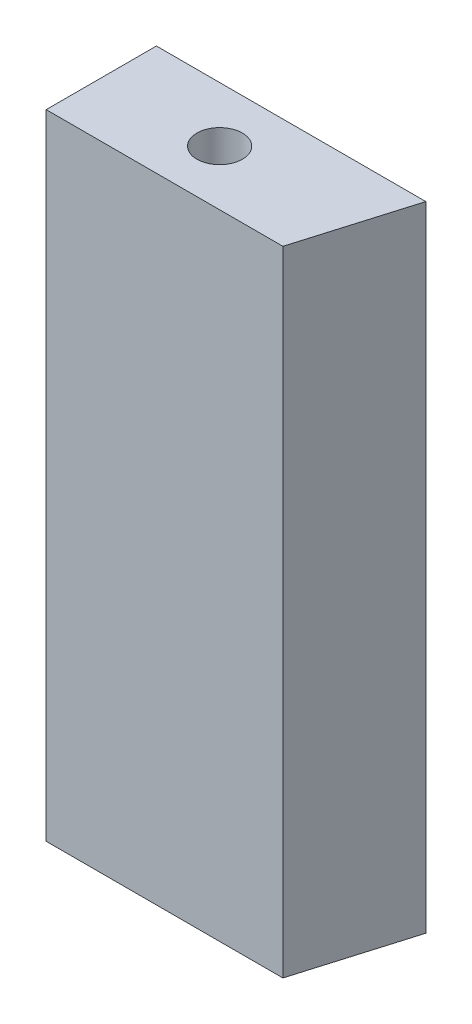
ISO-10303-21;
HEADER;
FILE_DESCRIPTION(('STEP AP214'),'2;1');
FILE_NAME('part.step','',(''),(''),'','','');
FILE_SCHEMA(('AUTOMOTIVE_DESIGN { 1 0 10303 214 1 1 1 1 }'));
ENDSEC;
DATA;
#1=APPLICATION_CONTEXT('core data for automotive mechanical design processes');
#2=APPLICATION_PROTOCOL_DEFINITION('international standard','automotive_design',2000,#1);
#3=PRODUCT_CONTEXT('',#1,'mechanical');
#4=PRODUCT('Part','Part','',(#3));
#5=PRODUCT_RELATED_PRODUCT_CATEGORY('part','',(#4));
#6=PRODUCT_DEFINITION_FORMATION('','',#4);
#7=PRODUCT_DEFINITION_CONTEXT('part definition',#1,'design');
#8=PRODUCT_DEFINITION('design','',#6,#7);
#9=PRODUCT_DEFINITION_SHAPE('','',#8);
#10=(LENGTH_UNIT() NAMED_UNIT(*) SI_UNIT(.MILLI.,.METRE.));
#11=(NAMED_UNIT(*) PLANE_ANGLE_UNIT() SI_UNIT($,.RADIAN.));
#12=(NAMED_UNIT(*) SI_UNIT($,.STERADIAN.) SOLID_ANGLE_UNIT());
#13=UNCERTAINTY_MEASURE_WITH_UNIT(LENGTH_MEASURE(1.E-05),#10,'distance_accuracy_value','');
#14=(GEOMETRIC_REPRESENTATION_CONTEXT(3) GLOBAL_UNCERTAINTY_ASSIGNED_CONTEXT((#13)) GLOBAL_UNIT_ASSIGNED_CONTEXT((#10,
#11,#12)) REPRESENTATION_CONTEXT('',''));
#15=CARTESIAN_POINT('',(0.,0.,0.));
#16=DIRECTION('',(0.,0.,1.));
#17=DIRECTION('',(1.,0.,0.));
#18=AXIS2_PLACEMENT_3D('',#15,#16,#17);
#19=CARTESIAN_POINT('',(-82.,46.,89.9999999999999));
#20=DIRECTION('',(0.,0.,-1.));
#21=DIRECTION('',(-1.,0.,0.));
#22=AXIS2_PLACEMENT_3D('',#19,#20,#21);
#23=PLANE('',#22);
#24=DIRECTION('',(1.,0.,0.));
#25=VECTOR('',#24,1.);
#26=CARTESIAN_POINT('',(-82.,0.,89.9999999999999));
#27=LINE('',#26,#25);
#28=CARTESIAN_POINT('',(-82.,0.,89.9999999999999));
#29=VERTEX_POINT('',#28);
#30=CARTESIAN_POINT('',(-64.81666667,0.,89.9999999999999));
#31=VERTEX_POINT('',#30);
#32=EDGE_CURVE('E100',#29,#31,#27,.T.);
#33=ORIENTED_EDGE('',*,*,#32,.T.);
#34=DIRECTION('',(0.,-1.,0.));
#35=VECTOR('',#34,1.);
#36=CARTESIAN_POINT('',(-64.81666667,46.,89.9999999999999));
#37=LINE('',#36,#35);
#38=CARTESIAN_POINT('',(-64.81666667,46.,89.9999999999999));
#39=VERTEX_POINT('',#38);
#40=EDGE_CURVE('E11',#39,#31,#37,.T.);
#41=ORIENTED_EDGE('',*,*,#40,.F.);
#42=DIRECTION('',(1.,0.,0.));
#43=VECTOR('',#42,1.);
#44=CARTESIAN_POINT('',(-82.,46.,89.9999999999999));
#45=LINE('',#44,#43);
#46=CARTESIAN_POINT('',(-82.,46.,89.9999999999999));
#47=VERTEX_POINT('',#46);
#48=EDGE_CURVE('E88',#47,#39,#45,.T.);
#49=ORIENTED_EDGE('',*,*,#48,.F.);
#50=DIRECTION('',(0.,-1.,0.));
#51=VECTOR('',#50,1.);
#52=CARTESIAN_POINT('',(-82.,46.,89.9999999999999));
#53=LINE('',#52,#51);
#54=EDGE_CURVE('E96',#47,#29,#53,.T.);
#55=ORIENTED_EDGE('',*,*,#54,.T.);
#56=EDGE_LOOP('',(#33,#41,#49,#55));
#57=FACE_BOUND('',#56,.T.);
#58=ADVANCED_FACE('F37',(#57),#23,.F.);
#59=CARTESIAN_POINT('',(-62.44333333,46.,81.9999999999999));
#60=DIRECTION('',(-0.958701340524313,0.,-0.284414731821129));
#61=DIRECTION('',(-0.284414731821129,0.,0.958701340524313));
#62=AXIS2_PLACEMENT_3D('',#59,#60,#61);
#63=PLANE('',#62);
#64=DIRECTION('',(0.284414731821129,0.,-0.958701340524313));
#65=VECTOR('',#64,1.);
#66=CARTESIAN_POINT('',(-62.44333333,0.,81.9999999999999));
#67=LINE('',#66,#65);
#68=CARTESIAN_POINT('',(-62.44333333,0.,81.9999999999999));
#69=VERTEX_POINT('',#68);
#70=EDGE_CURVE('E92',#31,#69,#67,.T.);
#71=ORIENTED_EDGE('',*,*,#70,.T.);
#72=DIRECTION('',(0.,-1.,0.));
#73=VECTOR('',#72,1.);
#74=CARTESIAN_POINT('',(-62.44333333,46.,81.9999999999999));
#75=LINE('',#74,#73);
#76=CARTESIAN_POINT('',(-62.44333333,46.,81.9999999999999));
#77=VERTEX_POINT('',#76);
#78=EDGE_CURVE('E45',#77,#69,#75,.T.);
#79=ORIENTED_EDGE('',*,*,#78,.F.);
#80=DIRECTION('',(0.284414731821129,0.,-0.958701340524313));
#81=VECTOR('',#80,1.);
#82=CARTESIAN_POINT('',(-62.44333333,46.,81.9999999999999));
#83=LINE('',#82,#81);
#84=EDGE_CURVE('E83',#39,#77,#83,.T.);
#85=ORIENTED_EDGE('',*,*,#84,.F.);
#86=ORIENTED_EDGE('',*,*,#40,.T.);
#87=EDGE_LOOP('',(#71,#79,#85,#86));
#88=FACE_BOUND('',#87,.T.);
#89=ADVANCED_FACE('F91',(#88),#63,.F.);
#90=CARTESIAN_POINT('',(-82.,46.,81.9999999999999));
#91=DIRECTION('',(0.,0.,1.));
#92=DIRECTION('',(1.,0.,0.));
#93=AXIS2_PLACEMENT_3D('',#90,#91,#92);
#94=PLANE('',#93);
#95=DIRECTION('',(-1.,0.,0.));
#96=VECTOR('',#95,1.);
#97=CARTESIAN_POINT('',(-82.,0.,81.9999999999999));
#98=LINE('',#97,#96);
#99=CARTESIAN_POINT('',(-82.,0.,81.9999999999999));
#100=VERTEX_POINT('',#99);
#101=EDGE_CURVE('E70',#69,#100,#98,.T.);
#102=ORIENTED_EDGE('',*,*,#101,.T.);
#103=DIRECTION('',(0.,-1.,0.));
#104=VECTOR('',#103,1.);
#105=CARTESIAN_POINT('',(-82.,46.,81.9999999999999));
#106=LINE('',#105,#104);
#107=CARTESIAN_POINT('',(-82.,46.,81.9999999999999));
#108=VERTEX_POINT('',#107);
#109=EDGE_CURVE('E93',#108,#100,#106,.T.);
#110=ORIENTED_EDGE('',*,*,#109,.F.);
#111=DIRECTION('',(-1.,0.,0.));
#112=VECTOR('',#111,1.);
#113=CARTESIAN_POINT('',(-82.,46.,81.9999999999999));
#114=LINE('',#113,#112);
#115=EDGE_CURVE('E86',#77,#108,#114,.T.);
#116=ORIENTED_EDGE('',*,*,#115,.F.);
#117=ORIENTED_EDGE('',*,*,#78,.T.);
#118=EDGE_LOOP('',(#102,#110,#116,#117));
#119=FACE_BOUND('',#118,.T.);
#120=ADVANCED_FACE('F94',(#119),#94,.F.);
#121=CARTESIAN_POINT('',(-82.,46.,89.9999999999999));
#122=DIRECTION('',(1.,0.,0.));
#123=DIRECTION('',(0.,0.,-1.));
#124=AXIS2_PLACEMENT_3D('',#121,#122,#123);
#125=PLANE('',#124);
#126=CARTESIAN_POINT('',(-82.,34.5,85.9999999999999));
#127=DIRECTION('',(-1.,0.,0.));
#128=DIRECTION('',(0.,0.,1.));
#129=AXIS2_PLACEMENT_3D('',#126,#127,#128);
#130=CIRCLE('',#129,1.65);
#131=CARTESIAN_POINT('',(-82.,34.5,87.6499999999999));
#132=VERTEX_POINT('',#131);
#133=EDGE_CURVE('E126',#132,#132,#130,.T.);
#134=ORIENTED_EDGE('',*,*,#133,.F.);
#135=EDGE_LOOP('',(#134));
#136=FACE_BOUND('',#135,.T.);
#137=CARTESIAN_POINT('',(-82.,11.5,85.9999999999999));
#138=DIRECTION('',(-1.,0.,0.));
#139=DIRECTION('',(0.,0.,-1.));
#140=AXIS2_PLACEMENT_3D('',#137,#138,#139);
#141=CIRCLE('',#140,1.65);
#142=CARTESIAN_POINT('',(-82.,11.5,84.3499999999999));
#143=VERTEX_POINT('',#142);
#144=EDGE_CURVE('E123',#143,#143,#141,.T.);
#145=ORIENTED_EDGE('',*,*,#144,.F.);
#146=EDGE_LOOP('',(#145));
#147=FACE_BOUND('',#146,.T.);
#148=DIRECTION('',(0.,0.,1.));
#149=VECTOR('',#148,1.);
#150=CARTESIAN_POINT('',(-82.,0.,89.9999999999999));
#151=LINE('',#150,#149);
#152=EDGE_CURVE('E76',#100,#29,#151,.T.);
#153=ORIENTED_EDGE('',*,*,#152,.T.);
#154=ORIENTED_EDGE('',*,*,#54,.F.);
#155=DIRECTION('',(0.,0.,1.));
#156=VECTOR('',#155,1.);
#157=CARTESIAN_POINT('',(-82.,46.,89.9999999999999));
#158=LINE('',#157,#156);
#159=EDGE_CURVE('E53',#108,#47,#158,.T.);
#160=ORIENTED_EDGE('',*,*,#159,.F.);
#161=ORIENTED_EDGE('',*,*,#109,.T.);
#162=EDGE_LOOP('',(#153,#154,#160,#161));
#163=FACE_BOUND('',#162,.T.);
#164=ADVANCED_FACE('F108',(#136,#147,#163),#125,.F.);
#165=CARTESIAN_POINT('',(0.,46.,0.));
#166=DIRECTION('',(0.,1.,0.));
#167=DIRECTION('',(0.,0.,1.));
#168=AXIS2_PLACEMENT_3D('',#165,#166,#167);
#169=PLANE('',#168);
#170=CARTESIAN_POINT('',(-73.41,46.,85.9999999999999));
#171=DIRECTION('',(0.,1.,0.));
#172=DIRECTION('',(0.,0.,1.));
#173=AXIS2_PLACEMENT_3D('',#170,#171,#172);
#174=CIRCLE('',#173,1.65);
#175=CARTESIAN_POINT('',(-73.41,46.,87.6499999999999));
#176=VERTEX_POINT('',#175);
#177=EDGE_CURVE('E114',#176,#176,#174,.F.);
#178=ORIENTED_EDGE('',*,*,#177,.T.);
#179=EDGE_LOOP('',(#178));
#180=FACE_BOUND('',#179,.T.);
#181=ORIENTED_EDGE('',*,*,#48,.T.);
#182=ORIENTED_EDGE('',*,*,#84,.T.);
#183=ORIENTED_EDGE('',*,*,#115,.T.);
#184=ORIENTED_EDGE('',*,*,#159,.T.);
#185=EDGE_LOOP('',(#181,#182,#183,#184));
#186=FACE_BOUND('',#185,.T.);
#187=ADVANCED_FACE('F84',(#180,#186),#169,.T.);
#188=CARTESIAN_POINT('',(0.,0.,0.));
#189=DIRECTION('',(0.,1.,0.));
#190=DIRECTION('',(0.,0.,1.));
#191=AXIS2_PLACEMENT_3D('',#188,#189,#190);
#192=PLANE('',#191);
#193=CARTESIAN_POINT('',(-73.41,0.,85.9999999999999));
#194=DIRECTION('',(0.,-1.,0.));
#195=DIRECTION('',(0.,0.,-1.));
#196=AXIS2_PLACEMENT_3D('',#193,#194,#195);
#197=CIRCLE('',#196,1.65);
#198=CARTESIAN_POINT('',(-73.41,0.,84.3499999999999));
#199=VERTEX_POINT('',#198);
#200=EDGE_CURVE('E103',#199,#199,#197,.T.);
#201=ORIENTED_EDGE('',*,*,#200,.F.);
#202=EDGE_LOOP('',(#201));
#203=FACE_BOUND('',#202,.T.);
#204=ORIENTED_EDGE('',*,*,#32,.F.);
#205=ORIENTED_EDGE('',*,*,#152,.F.);
#206=ORIENTED_EDGE('',*,*,#101,.F.);
#207=ORIENTED_EDGE('',*,*,#70,.F.);
#208=EDGE_LOOP('',(#204,#205,#206,#207));
#209=FACE_BOUND('',#208,.T.);
#210=ADVANCED_FACE('F111',(#203,#209),#192,.F.);
#211=CARTESIAN_POINT('',(-73.41,46.001,85.9999999999999));
#212=DIRECTION('',(0.,-1.,0.));
#213=DIRECTION('',(0.,0.,-1.));
#214=AXIS2_PLACEMENT_3D('',#211,#212,#213);
#215=CYLINDRICAL_SURFACE('',#214,1.65);
#216=ORIENTED_EDGE('',*,*,#177,.F.);
#217=EDGE_LOOP('',(#216));
#218=FACE_BOUND('',#217,.T.);
#219=ORIENTED_EDGE('',*,*,#200,.T.);
#220=EDGE_LOOP('',(#219));
#221=FACE_BOUND('',#220,.T.);
#222=ADVANCED_FACE('F148',(#218,#221),#215,.F.);
#223=CARTESIAN_POINT('',(-77.,11.5,85.9999999999999));
#224=DIRECTION('',(-1.,0.,0.));
#225=DIRECTION('',(0.,0.,1.));
#226=AXIS2_PLACEMENT_3D('',#223,#224,#225);
#227=CYLINDRICAL_SURFACE('',#226,1.65);
#228=CARTESIAN_POINT('',(-77.,11.5,85.9999999999999));
#229=DIRECTION('',(-1.,0.,0.));
#230=DIRECTION('',(0.,0.,-1.));
#231=AXIS2_PLACEMENT_3D('',#228,#229,#230);
#232=CIRCLE('',#231,1.65);
#233=CARTESIAN_POINT('',(-77.,11.5,84.3499999999999));
#234=VERTEX_POINT('',#233);
#235=EDGE_CURVE('E120',#234,#234,#232,.T.);
#236=ORIENTED_EDGE('',*,*,#235,.F.);
#237=EDGE_LOOP('',(#236));
#238=FACE_BOUND('',#237,.T.);
#239=ORIENTED_EDGE('',*,*,#144,.T.);
#240=EDGE_LOOP('',(#239));
#241=FACE_BOUND('',#240,.T.);
#242=ADVANCED_FACE('F146',(#238,#241),#227,.F.);
#243=CARTESIAN_POINT('',(-77.,11.5,85.9999999999999));
#244=DIRECTION('',(1.,0.,0.));
#245=DIRECTION('',(0.,0.,-1.));
#246=AXIS2_PLACEMENT_3D('',#243,#244,#245);
#247=PLANE('',#246);
#248=ORIENTED_EDGE('',*,*,#235,.T.);
#249=EDGE_LOOP('',(#248));
#250=FACE_BOUND('',#249,.T.);
#251=ADVANCED_FACE('F137',(#250),#247,.F.);
#252=CARTESIAN_POINT('',(-77.,34.5,85.9999999999999));
#253=DIRECTION('',(-1.,0.,0.));
#254=DIRECTION('',(0.,0.,1.));
#255=AXIS2_PLACEMENT_3D('',#252,#253,#254);
#256=CYLINDRICAL_SURFACE('',#255,1.65);
#257=CARTESIAN_POINT('',(-77.,34.5,85.9999999999999));
#258=DIRECTION('',(-1.,0.,0.));
#259=DIRECTION('',(0.,0.,1.));
#260=AXIS2_PLACEMENT_3D('',#257,#258,#259);
#261=CIRCLE('',#260,1.65);
#262=CARTESIAN_POINT('',(-77.,34.5,87.6499999999999));
#263=VERTEX_POINT('',#262);
#264=EDGE_CURVE('E117',#263,#263,#261,.T.);
#265=ORIENTED_EDGE('',*,*,#264,.F.);
#266=EDGE_LOOP('',(#265));
#267=FACE_BOUND('',#266,.T.);
#268=ORIENTED_EDGE('',*,*,#133,.T.);
#269=EDGE_LOOP('',(#268));
#270=FACE_BOUND('',#269,.T.);
#271=ADVANCED_FACE('F134',(#267,#270),#256,.F.);
#272=CARTESIAN_POINT('',(-77.,34.5,85.9999999999999));
#273=DIRECTION('',(-1.,0.,0.));
#274=DIRECTION('',(0.,0.,1.));
#275=AXIS2_PLACEMENT_3D('',#272,#273,#274);
#276=PLANE('',#275);
#277=ORIENTED_EDGE('',*,*,#264,.T.);
#278=EDGE_LOOP('',(#277));
#279=FACE_BOUND('',#278,.T.);
#280=ADVANCED_FACE('F132',(#279),#276,.T.);
#281=CLOSED_SHELL('',(#58,#89,#120,#164,#187,#210,#222,#242,#251,#271,#280));
#282=MANIFOLD_SOLID_BREP('B2',#281);
#283=ADVANCED_BREP_SHAPE_REPRESENTATION('',(#18,#282),#14);
#284=SHAPE_DEFINITION_REPRESENTATION(#9,#283);
ENDSEC;
END-ISO-10303-21;
